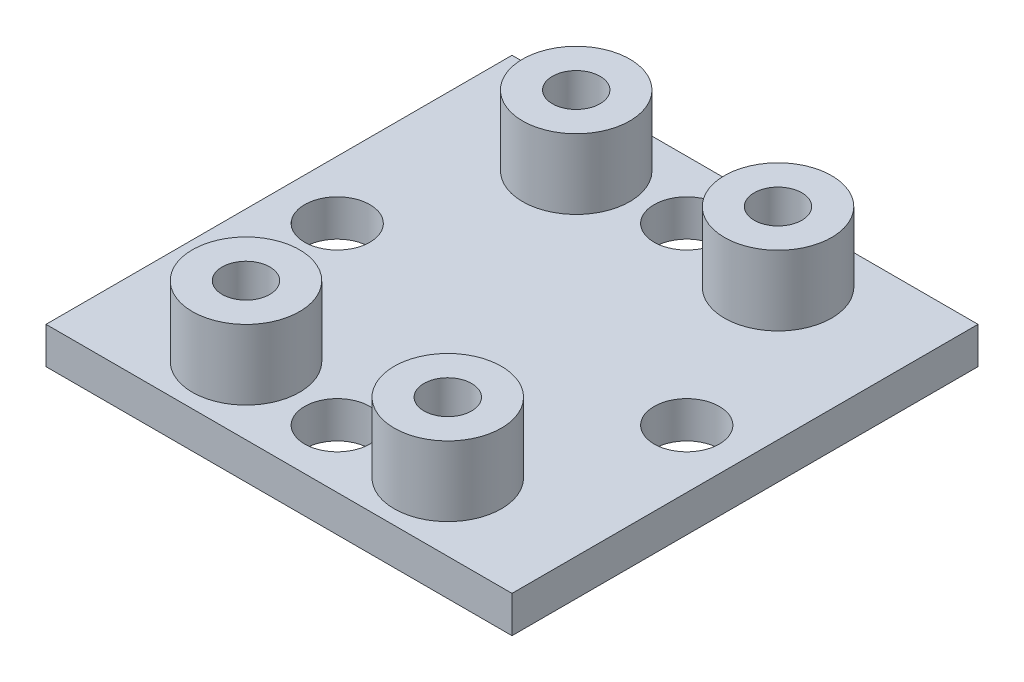
ISO-10303-21;
HEADER;
FILE_DESCRIPTION(('STEP AP214'),'2;1');
FILE_NAME('part.step','',(''),(''),'','','');
FILE_SCHEMA(('AUTOMOTIVE_DESIGN { 1 0 10303 214 1 1 1 1 }'));
ENDSEC;
DATA;
#1=APPLICATION_CONTEXT('core data for automotive mechanical design processes');
#2=APPLICATION_PROTOCOL_DEFINITION('international standard','automotive_design',2000,#1);
#3=PRODUCT_CONTEXT('',#1,'mechanical');
#4=PRODUCT('Part','Part','',(#3));
#5=PRODUCT_RELATED_PRODUCT_CATEGORY('part','',(#4));
#6=PRODUCT_DEFINITION_FORMATION('','',#4);
#7=PRODUCT_DEFINITION_CONTEXT('part definition',#1,'design');
#8=PRODUCT_DEFINITION('design','',#6,#7);
#9=PRODUCT_DEFINITION_SHAPE('','',#8);
#10=(LENGTH_UNIT() NAMED_UNIT(*) SI_UNIT(.MILLI.,.METRE.));
#11=(NAMED_UNIT(*) PLANE_ANGLE_UNIT() SI_UNIT($,.RADIAN.));
#12=(NAMED_UNIT(*) SI_UNIT($,.STERADIAN.) SOLID_ANGLE_UNIT());
#13=UNCERTAINTY_MEASURE_WITH_UNIT(LENGTH_MEASURE(1.E-05),#10,'distance_accuracy_value','');
#14=(GEOMETRIC_REPRESENTATION_CONTEXT(3) GLOBAL_UNCERTAINTY_ASSIGNED_CONTEXT((#13)) GLOBAL_UNIT_ASSIGNED_CONTEXT((#10,
#11,#12)) REPRESENTATION_CONTEXT('',''));
#15=CARTESIAN_POINT('',(0.,0.,0.));
#16=DIRECTION('',(0.,0.,1.));
#17=DIRECTION('',(1.,0.,0.));
#18=AXIS2_PLACEMENT_3D('',#15,#16,#17);
#19=CARTESIAN_POINT('',(-12.7,2.,-12.7));
#20=DIRECTION('',(1.,0.,0.));
#21=DIRECTION('',(0.,0.,-1.));
#22=AXIS2_PLACEMENT_3D('',#19,#20,#21);
#23=PLANE('',#22);
#24=DIRECTION('',(0.,0.,1.));
#25=VECTOR('',#24,1.);
#26=CARTESIAN_POINT('',(-12.7,0.,-12.7));
#27=LINE('',#26,#25);
#28=CARTESIAN_POINT('',(-12.7,0.,-12.7));
#29=VERTEX_POINT('',#28);
#30=CARTESIAN_POINT('',(-12.7,0.,12.7));
#31=VERTEX_POINT('',#30);
#32=EDGE_CURVE('E103',#29,#31,#27,.T.);
#33=ORIENTED_EDGE('',*,*,#32,.T.);
#34=DIRECTION('',(0.,-1.,0.));
#35=VECTOR('',#34,1.);
#36=CARTESIAN_POINT('',(-12.7,2.,12.7));
#37=LINE('',#36,#35);
#38=CARTESIAN_POINT('',(-12.7,2.,12.7));
#39=VERTEX_POINT('',#38);
#40=EDGE_CURVE('E94',#39,#31,#37,.T.);
#41=ORIENTED_EDGE('',*,*,#40,.F.);
#42=DIRECTION('',(0.,0.,1.));
#43=VECTOR('',#42,1.);
#44=CARTESIAN_POINT('',(-12.7,2.,-12.7));
#45=LINE('',#44,#43);
#46=CARTESIAN_POINT('',(-12.7,2.,-12.7));
#47=VERTEX_POINT('',#46);
#48=EDGE_CURVE('E88',#47,#39,#45,.T.);
#49=ORIENTED_EDGE('',*,*,#48,.F.);
#50=DIRECTION('',(0.,-1.,0.));
#51=VECTOR('',#50,1.);
#52=CARTESIAN_POINT('',(-12.7,2.,-12.7));
#53=LINE('',#52,#51);
#54=EDGE_CURVE('E99',#47,#29,#53,.T.);
#55=ORIENTED_EDGE('',*,*,#54,.T.);
#56=EDGE_LOOP('',(#33,#41,#49,#55));
#57=FACE_BOUND('',#56,.T.);
#58=ADVANCED_FACE('F36',(#57),#23,.F.);
#59=CARTESIAN_POINT('',(-12.7,2.,12.7));
#60=DIRECTION('',(0.,0.,-1.));
#61=DIRECTION('',(-1.,0.,0.));
#62=AXIS2_PLACEMENT_3D('',#59,#60,#61);
#63=PLANE('',#62);
#64=DIRECTION('',(1.,0.,0.));
#65=VECTOR('',#64,1.);
#66=CARTESIAN_POINT('',(-12.7,0.,12.7));
#67=LINE('',#66,#65);
#68=CARTESIAN_POINT('',(12.7,0.,12.7));
#69=VERTEX_POINT('',#68);
#70=EDGE_CURVE('E93',#31,#69,#67,.T.);
#71=ORIENTED_EDGE('',*,*,#70,.T.);
#72=DIRECTION('',(0.,-1.,0.));
#73=VECTOR('',#72,1.);
#74=CARTESIAN_POINT('',(12.7,2.,12.7));
#75=LINE('',#74,#73);
#76=CARTESIAN_POINT('',(12.7,2.,12.7));
#77=VERTEX_POINT('',#76);
#78=EDGE_CURVE('E91',#77,#69,#75,.T.);
#79=ORIENTED_EDGE('',*,*,#78,.F.);
#80=DIRECTION('',(1.,0.,0.));
#81=VECTOR('',#80,1.);
#82=CARTESIAN_POINT('',(-12.7,2.,12.7));
#83=LINE('',#82,#81);
#84=EDGE_CURVE('E83',#39,#77,#83,.T.);
#85=ORIENTED_EDGE('',*,*,#84,.F.);
#86=ORIENTED_EDGE('',*,*,#40,.T.);
#87=EDGE_LOOP('',(#71,#79,#85,#86));
#88=FACE_BOUND('',#87,.T.);
#89=ADVANCED_FACE('F92',(#88),#63,.F.);
#90=CARTESIAN_POINT('',(12.7,2.,-12.7));
#91=DIRECTION('',(-1.,0.,0.));
#92=DIRECTION('',(0.,0.,1.));
#93=AXIS2_PLACEMENT_3D('',#90,#91,#92);
#94=PLANE('',#93);
#95=DIRECTION('',(0.,0.,-1.));
#96=VECTOR('',#95,1.);
#97=CARTESIAN_POINT('',(12.7,0.,-12.7));
#98=LINE('',#97,#96);
#99=CARTESIAN_POINT('',(12.7,0.,-12.7));
#100=VERTEX_POINT('',#99);
#101=EDGE_CURVE('E69',#69,#100,#98,.T.);
#102=ORIENTED_EDGE('',*,*,#101,.T.);
#103=DIRECTION('',(0.,-1.,0.));
#104=VECTOR('',#103,1.);
#105=CARTESIAN_POINT('',(12.7,2.,-12.7));
#106=LINE('',#105,#104);
#107=CARTESIAN_POINT('',(12.7,2.,-12.7));
#108=VERTEX_POINT('',#107);
#109=EDGE_CURVE('E95',#108,#100,#106,.T.);
#110=ORIENTED_EDGE('',*,*,#109,.F.);
#111=DIRECTION('',(0.,0.,-1.));
#112=VECTOR('',#111,1.);
#113=CARTESIAN_POINT('',(12.7,2.,-12.7));
#114=LINE('',#113,#112);
#115=EDGE_CURVE('E86',#77,#108,#114,.T.);
#116=ORIENTED_EDGE('',*,*,#115,.F.);
#117=ORIENTED_EDGE('',*,*,#78,.T.);
#118=EDGE_LOOP('',(#102,#110,#116,#117));
#119=FACE_BOUND('',#118,.T.);
#120=ADVANCED_FACE('F97',(#119),#94,.F.);
#121=CARTESIAN_POINT('',(-12.7,2.,-12.7));
#122=DIRECTION('',(0.,0.,1.));
#123=DIRECTION('',(1.,0.,0.));
#124=AXIS2_PLACEMENT_3D('',#121,#122,#123);
#125=PLANE('',#124);
#126=DIRECTION('',(-1.,0.,0.));
#127=VECTOR('',#126,1.);
#128=CARTESIAN_POINT('',(-12.7,0.,-12.7));
#129=LINE('',#128,#127);
#130=EDGE_CURVE('E75',#100,#29,#129,.T.);
#131=ORIENTED_EDGE('',*,*,#130,.T.);
#132=ORIENTED_EDGE('',*,*,#54,.F.);
#133=DIRECTION('',(-1.,0.,0.));
#134=VECTOR('',#133,1.);
#135=CARTESIAN_POINT('',(-12.7,2.,-12.7));
#136=LINE('',#135,#134);
#137=EDGE_CURVE('E52',#108,#47,#136,.T.);
#138=ORIENTED_EDGE('',*,*,#137,.F.);
#139=ORIENTED_EDGE('',*,*,#109,.T.);
#140=EDGE_LOOP('',(#131,#132,#138,#139));
#141=FACE_BOUND('',#140,.T.);
#142=ADVANCED_FACE('F167',(#141),#125,.F.);
#143=CARTESIAN_POINT('',(0.,2.,0.));
#144=DIRECTION('',(0.,1.,0.));
#145=DIRECTION('',(0.,0.,1.));
#146=AXIS2_PLACEMENT_3D('',#143,#144,#145);
#147=PLANE('',#146);
#148=CARTESIAN_POINT('',(0.,2.,-9.525));
#149=DIRECTION('',(0.,1.,0.));
#150=DIRECTION('',(0.,0.,1.));
#151=AXIS2_PLACEMENT_3D('',#148,#149,#150);
#152=CIRCLE('',#151,1.778);
#153=CARTESIAN_POINT('',(0.,2.,-7.747));
#154=VERTEX_POINT('',#153);
#155=EDGE_CURVE('E320',#154,#154,#152,.F.);
#156=ORIENTED_EDGE('',*,*,#155,.T.);
#157=EDGE_LOOP('',(#156));
#158=FACE_BOUND('',#157,.T.);
#159=CARTESIAN_POINT('',(9.525,2.,0.));
#160=DIRECTION('',(0.,1.,0.));
#161=DIRECTION('',(0.,0.,1.));
#162=AXIS2_PLACEMENT_3D('',#159,#160,#161);
#163=CIRCLE('',#162,1.778);
#164=CARTESIAN_POINT('',(9.525,2.,1.778));
#165=VERTEX_POINT('',#164);
#166=EDGE_CURVE('E323',#165,#165,#163,.F.);
#167=ORIENTED_EDGE('',*,*,#166,.T.);
#168=EDGE_LOOP('',(#167));
#169=FACE_BOUND('',#168,.T.);
#170=CARTESIAN_POINT('',(0.,2.,9.525));
#171=DIRECTION('',(0.,1.,0.));
#172=DIRECTION('',(0.,0.,1.));
#173=AXIS2_PLACEMENT_3D('',#170,#171,#172);
#174=CIRCLE('',#173,1.778);
#175=CARTESIAN_POINT('',(0.,2.,11.303));
#176=VERTEX_POINT('',#175);
#177=EDGE_CURVE('E326',#176,#176,#174,.F.);
#178=ORIENTED_EDGE('',*,*,#177,.T.);
#179=EDGE_LOOP('',(#178));
#180=FACE_BOUND('',#179,.T.);
#181=CARTESIAN_POINT('',(-5.5,2.,9.));
#182=DIRECTION('',(0.,1.,0.));
#183=DIRECTION('',(0.,0.,1.));
#184=AXIS2_PLACEMENT_3D('',#181,#182,#183);
#185=CIRCLE('',#184,2.921);
#186=CARTESIAN_POINT('',(-5.5,2.,11.921));
#187=VERTEX_POINT('',#186);
#188=EDGE_CURVE('E312',#187,#187,#185,.T.);
#189=ORIENTED_EDGE('',*,*,#188,.F.);
#190=EDGE_LOOP('',(#189));
#191=FACE_BOUND('',#190,.T.);
#192=CARTESIAN_POINT('',(5.5,2.,9.));
#193=DIRECTION('',(0.,1.,0.));
#194=DIRECTION('',(0.,0.,1.));
#195=AXIS2_PLACEMENT_3D('',#192,#193,#194);
#196=CIRCLE('',#195,2.921);
#197=CARTESIAN_POINT('',(5.5,2.,11.921));
#198=VERTEX_POINT('',#197);
#199=EDGE_CURVE('E303',#198,#198,#196,.T.);
#200=ORIENTED_EDGE('',*,*,#199,.F.);
#201=EDGE_LOOP('',(#200));
#202=FACE_BOUND('',#201,.T.);
#203=CARTESIAN_POINT('',(5.5,2.,-9.));
#204=DIRECTION('',(0.,1.,0.));
#205=DIRECTION('',(0.,0.,1.));
#206=AXIS2_PLACEMENT_3D('',#203,#204,#205);
#207=CIRCLE('',#206,2.921);
#208=CARTESIAN_POINT('',(5.5,2.,-6.079));
#209=VERTEX_POINT('',#208);
#210=EDGE_CURVE('E294',#209,#209,#207,.T.);
#211=ORIENTED_EDGE('',*,*,#210,.F.);
#212=EDGE_LOOP('',(#211));
#213=FACE_BOUND('',#212,.T.);
#214=CARTESIAN_POINT('',(-5.5,2.,-9.));
#215=DIRECTION('',(0.,1.,0.));
#216=DIRECTION('',(0.,0.,1.));
#217=AXIS2_PLACEMENT_3D('',#214,#215,#216);
#218=CIRCLE('',#217,2.921);
#219=CARTESIAN_POINT('',(-5.5,2.,-6.079));
#220=VERTEX_POINT('',#219);
#221=EDGE_CURVE('E275',#220,#220,#218,.T.);
#222=ORIENTED_EDGE('',*,*,#221,.F.);
#223=EDGE_LOOP('',(#222));
#224=FACE_BOUND('',#223,.T.);
#225=CARTESIAN_POINT('',(-9.525,2.,0.));
#226=DIRECTION('',(0.,1.,0.));
#227=DIRECTION('',(0.,0.,1.));
#228=AXIS2_PLACEMENT_3D('',#225,#226,#227);
#229=CIRCLE('',#228,1.778);
#230=CARTESIAN_POINT('',(-9.525,2.,1.778));
#231=VERTEX_POINT('',#230);
#232=EDGE_CURVE('E106',#231,#231,#229,.T.);
#233=ORIENTED_EDGE('',*,*,#232,.F.);
#234=EDGE_LOOP('',(#233));
#235=FACE_BOUND('',#234,.T.);
#236=ORIENTED_EDGE('',*,*,#48,.T.);
#237=ORIENTED_EDGE('',*,*,#84,.T.);
#238=ORIENTED_EDGE('',*,*,#115,.T.);
#239=ORIENTED_EDGE('',*,*,#137,.T.);
#240=EDGE_LOOP('',(#236,#237,#238,#239));
#241=FACE_BOUND('',#240,.T.);
#242=ADVANCED_FACE('F84',(#158,#169,#180,#191,#202,#213,#224,#235,#241),#147,.T.);
#243=CARTESIAN_POINT('',(0.,0.,0.));
#244=DIRECTION('',(0.,1.,0.));
#245=DIRECTION('',(0.,0.,1.));
#246=AXIS2_PLACEMENT_3D('',#243,#244,#245);
#247=PLANE('',#246);
#248=CARTESIAN_POINT('',(0.,0.,-9.525));
#249=DIRECTION('',(0.,1.,0.));
#250=DIRECTION('',(-1.,0.,0.));
#251=AXIS2_PLACEMENT_3D('',#248,#249,#250);
#252=CIRCLE('',#251,1.778);
#253=CARTESIAN_POINT('',(-1.77799999999997,0.,-9.52500000000001));
#254=VERTEX_POINT('',#253);
#255=EDGE_CURVE('E329',#254,#254,#252,.T.);
#256=ORIENTED_EDGE('',*,*,#255,.T.);
#257=EDGE_LOOP('',(#256));
#258=FACE_BOUND('',#257,.T.);
#259=CARTESIAN_POINT('',(9.525,0.,0.));
#260=DIRECTION('',(0.,1.,0.));
#261=DIRECTION('',(0.,0.,-1.));
#262=AXIS2_PLACEMENT_3D('',#259,#260,#261);
#263=CIRCLE('',#262,1.778);
#264=CARTESIAN_POINT('',(9.525,0.,-1.778));
#265=VERTEX_POINT('',#264);
#266=EDGE_CURVE('E333',#265,#265,#263,.T.);
#267=ORIENTED_EDGE('',*,*,#266,.T.);
#268=EDGE_LOOP('',(#267));
#269=FACE_BOUND('',#268,.T.);
#270=CARTESIAN_POINT('',(0.,0.,9.525));
#271=DIRECTION('',(0.,1.,0.));
#272=DIRECTION('',(1.,0.,0.));
#273=AXIS2_PLACEMENT_3D('',#270,#271,#272);
#274=CIRCLE('',#273,1.778);
#275=CARTESIAN_POINT('',(1.7779999999999,0.,9.52500000000002));
#276=VERTEX_POINT('',#275);
#277=EDGE_CURVE('E330',#276,#276,#274,.T.);
#278=ORIENTED_EDGE('',*,*,#277,.T.);
#279=EDGE_LOOP('',(#278));
#280=FACE_BOUND('',#279,.T.);
#281=CARTESIAN_POINT('',(-9.525,0.,0.));
#282=DIRECTION('',(0.,1.,0.));
#283=DIRECTION('',(0.,0.,1.));
#284=AXIS2_PLACEMENT_3D('',#281,#282,#283);
#285=CIRCLE('',#284,1.778);
#286=CARTESIAN_POINT('',(-9.525,0.,1.778));
#287=VERTEX_POINT('',#286);
#288=EDGE_CURVE('E279',#287,#287,#285,.T.);
#289=ORIENTED_EDGE('',*,*,#288,.T.);
#290=EDGE_LOOP('',(#289));
#291=FACE_BOUND('',#290,.T.);
#292=ORIENTED_EDGE('',*,*,#32,.F.);
#293=ORIENTED_EDGE('',*,*,#130,.F.);
#294=ORIENTED_EDGE('',*,*,#101,.F.);
#295=ORIENTED_EDGE('',*,*,#70,.F.);
#296=EDGE_LOOP('',(#292,#293,#294,#295));
#297=FACE_BOUND('',#296,.T.);
#298=ADVANCED_FACE('F157',(#258,#269,#280,#291,#297),#247,.F.);
#299=CARTESIAN_POINT('',(-9.525,2.,0.));
#300=DIRECTION('',(0.,-1.,0.));
#301=DIRECTION('',(0.,0.,-1.));
#302=AXIS2_PLACEMENT_3D('',#299,#300,#301);
#303=CYLINDRICAL_SURFACE('',#302,1.778);
#304=ORIENTED_EDGE('',*,*,#232,.T.);
#305=EDGE_LOOP('',(#304));
#306=FACE_BOUND('',#305,.T.);
#307=ORIENTED_EDGE('',*,*,#288,.F.);
#308=EDGE_LOOP('',(#307));
#309=FACE_BOUND('',#308,.T.);
#310=ADVANCED_FACE('F159',(#306,#309),#303,.F.);
#311=CARTESIAN_POINT('',(-5.5,5.81,-9.));
#312=DIRECTION('',(0.,1.,0.));
#313=DIRECTION('',(0.,0.,1.));
#314=AXIS2_PLACEMENT_3D('',#311,#312,#313);
#315=PLANE('',#314);
#316=CARTESIAN_POINT('',(-5.5,5.81,-9.));
#317=DIRECTION('',(0.,1.,0.));
#318=DIRECTION('',(0.,0.,1.));
#319=AXIS2_PLACEMENT_3D('',#316,#317,#318);
#320=CIRCLE('',#319,2.921);
#321=CARTESIAN_POINT('',(-5.5,5.81,-6.079));
#322=VERTEX_POINT('',#321);
#323=EDGE_CURVE('E272',#322,#322,#320,.T.);
#324=ORIENTED_EDGE('',*,*,#323,.T.);
#325=EDGE_LOOP('',(#324));
#326=FACE_BOUND('',#325,.T.);
#327=CARTESIAN_POINT('',(-5.5,5.81,-9.));
#328=DIRECTION('',(0.,1.,0.));
#329=DIRECTION('',(0.,0.,1.));
#330=AXIS2_PLACEMENT_3D('',#327,#328,#329);
#331=CIRCLE('',#330,1.3);
#332=CARTESIAN_POINT('',(-5.5,5.81,-7.7));
#333=VERTEX_POINT('',#332);
#334=EDGE_CURVE('E277',#333,#333,#331,.T.);
#335=ORIENTED_EDGE('',*,*,#334,.F.);
#336=EDGE_LOOP('',(#335));
#337=FACE_BOUND('',#336,.T.);
#338=ADVANCED_FACE('F165',(#326,#337),#315,.T.);
#339=CARTESIAN_POINT('',(-5.5,5.81,-9.));
#340=DIRECTION('',(0.,-1.,0.));
#341=DIRECTION('',(0.,0.,-1.));
#342=AXIS2_PLACEMENT_3D('',#339,#340,#341);
#343=CYLINDRICAL_SURFACE('',#342,2.921);
#344=ORIENTED_EDGE('',*,*,#323,.F.);
#345=EDGE_LOOP('',(#344));
#346=FACE_BOUND('',#345,.T.);
#347=ORIENTED_EDGE('',*,*,#221,.T.);
#348=EDGE_LOOP('',(#347));
#349=FACE_BOUND('',#348,.T.);
#350=ADVANCED_FACE('F260',(#346,#349),#343,.T.);
#351=CARTESIAN_POINT('',(-5.5,5.81,-9.));
#352=DIRECTION('',(0.,-1.,0.));
#353=DIRECTION('',(0.,0.,-1.));
#354=AXIS2_PLACEMENT_3D('',#351,#352,#353);
#355=CYLINDRICAL_SURFACE('',#354,1.3);
#356=ORIENTED_EDGE('',*,*,#334,.T.);
#357=EDGE_LOOP('',(#356));
#358=FACE_BOUND('',#357,.T.);
#359=CARTESIAN_POINT('',(-5.5,2.,-9.));
#360=DIRECTION('',(0.,1.,0.));
#361=DIRECTION('',(0.,0.,1.));
#362=AXIS2_PLACEMENT_3D('',#359,#360,#361);
#363=CIRCLE('',#362,1.3);
#364=CARTESIAN_POINT('',(-5.5,2.,-7.7));
#365=VERTEX_POINT('',#364);
#366=EDGE_CURVE('E113',#365,#365,#363,.F.);
#367=ORIENTED_EDGE('',*,*,#366,.T.);
#368=EDGE_LOOP('',(#367));
#369=FACE_BOUND('',#368,.T.);
#370=ADVANCED_FACE('F257',(#358,#369),#355,.F.);
#371=ORIENTED_EDGE('',*,*,#366,.F.);
#372=EDGE_LOOP('',(#371));
#373=FACE_BOUND('',#372,.T.);
#374=ADVANCED_FACE('F145',(#373),#147,.T.);
#375=CARTESIAN_POINT('',(5.5,5.81,-9.));
#376=DIRECTION('',(0.,1.,0.));
#377=DIRECTION('',(0.,0.,1.));
#378=AXIS2_PLACEMENT_3D('',#375,#376,#377);
#379=PLANE('',#378);
#380=CARTESIAN_POINT('',(5.5,5.81,-9.));
#381=DIRECTION('',(0.,1.,0.));
#382=DIRECTION('',(0.,0.,1.));
#383=AXIS2_PLACEMENT_3D('',#380,#381,#382);
#384=CIRCLE('',#383,2.921);
#385=CARTESIAN_POINT('',(5.5,5.81,-6.079));
#386=VERTEX_POINT('',#385);
#387=EDGE_CURVE('E282',#386,#386,#384,.T.);
#388=ORIENTED_EDGE('',*,*,#387,.T.);
#389=EDGE_LOOP('',(#388));
#390=FACE_BOUND('',#389,.T.);
#391=CARTESIAN_POINT('',(5.5,5.81,-9.));
#392=DIRECTION('',(0.,1.,0.));
#393=DIRECTION('',(0.,0.,1.));
#394=AXIS2_PLACEMENT_3D('',#391,#392,#393);
#395=CIRCLE('',#394,1.3);
#396=CARTESIAN_POINT('',(5.5,5.81,-7.7));
#397=VERTEX_POINT('',#396);
#398=EDGE_CURVE('E297',#397,#397,#395,.T.);
#399=ORIENTED_EDGE('',*,*,#398,.F.);
#400=EDGE_LOOP('',(#399));
#401=FACE_BOUND('',#400,.T.);
#402=ADVANCED_FACE('F250',(#390,#401),#379,.T.);
#403=CARTESIAN_POINT('',(5.5,5.81,-9.));
#404=DIRECTION('',(0.,-1.,0.));
#405=DIRECTION('',(0.,0.,-1.));
#406=AXIS2_PLACEMENT_3D('',#403,#404,#405);
#407=CYLINDRICAL_SURFACE('',#406,2.921);
#408=ORIENTED_EDGE('',*,*,#387,.F.);
#409=EDGE_LOOP('',(#408));
#410=FACE_BOUND('',#409,.T.);
#411=ORIENTED_EDGE('',*,*,#210,.T.);
#412=EDGE_LOOP('',(#411));
#413=FACE_BOUND('',#412,.T.);
#414=ADVANCED_FACE('F248',(#410,#413),#407,.T.);
#415=CARTESIAN_POINT('',(5.5,5.81,-9.));
#416=DIRECTION('',(0.,-1.,0.));
#417=DIRECTION('',(0.,0.,-1.));
#418=AXIS2_PLACEMENT_3D('',#415,#416,#417);
#419=CYLINDRICAL_SURFACE('',#418,1.3);
#420=ORIENTED_EDGE('',*,*,#398,.T.);
#421=EDGE_LOOP('',(#420));
#422=FACE_BOUND('',#421,.T.);
#423=CARTESIAN_POINT('',(5.5,2.,-9.));
#424=DIRECTION('',(0.,1.,0.));
#425=DIRECTION('',(0.,0.,1.));
#426=AXIS2_PLACEMENT_3D('',#423,#424,#425);
#427=CIRCLE('',#426,1.3);
#428=CARTESIAN_POINT('',(5.5,2.,-7.7));
#429=VERTEX_POINT('',#428);
#430=EDGE_CURVE('E116',#429,#429,#427,.F.);
#431=ORIENTED_EDGE('',*,*,#430,.T.);
#432=EDGE_LOOP('',(#431));
#433=FACE_BOUND('',#432,.T.);
#434=ADVANCED_FACE('F143',(#422,#433),#419,.F.);
#435=ORIENTED_EDGE('',*,*,#430,.F.);
#436=EDGE_LOOP('',(#435));
#437=FACE_BOUND('',#436,.T.);
#438=ADVANCED_FACE('F127',(#437),#147,.T.);
#439=CARTESIAN_POINT('',(5.5,5.81,9.));
#440=DIRECTION('',(0.,1.,0.));
#441=DIRECTION('',(0.,0.,1.));
#442=AXIS2_PLACEMENT_3D('',#439,#440,#441);
#443=PLANE('',#442);
#444=CARTESIAN_POINT('',(5.5,5.81,9.));
#445=DIRECTION('',(0.,1.,0.));
#446=DIRECTION('',(0.,0.,1.));
#447=AXIS2_PLACEMENT_3D('',#444,#445,#446);
#448=CIRCLE('',#447,2.921);
#449=CARTESIAN_POINT('',(5.5,5.81,11.921));
#450=VERTEX_POINT('',#449);
#451=EDGE_CURVE('E302',#450,#450,#448,.T.);
#452=ORIENTED_EDGE('',*,*,#451,.T.);
#453=EDGE_LOOP('',(#452));
#454=FACE_BOUND('',#453,.T.);
#455=CARTESIAN_POINT('',(5.5,5.81,9.));
#456=DIRECTION('',(0.,1.,0.));
#457=DIRECTION('',(0.,0.,1.));
#458=AXIS2_PLACEMENT_3D('',#455,#456,#457);
#459=CIRCLE('',#458,1.3);
#460=CARTESIAN_POINT('',(5.5,5.81,10.3));
#461=VERTEX_POINT('',#460);
#462=EDGE_CURVE('E306',#461,#461,#459,.T.);
#463=ORIENTED_EDGE('',*,*,#462,.F.);
#464=EDGE_LOOP('',(#463));
#465=FACE_BOUND('',#464,.T.);
#466=ADVANCED_FACE('F142',(#454,#465),#443,.T.);
#467=CARTESIAN_POINT('',(5.5,5.81,9.));
#468=DIRECTION('',(0.,-1.,0.));
#469=DIRECTION('',(0.,0.,-1.));
#470=AXIS2_PLACEMENT_3D('',#467,#468,#469);
#471=CYLINDRICAL_SURFACE('',#470,2.921);
#472=ORIENTED_EDGE('',*,*,#451,.F.);
#473=EDGE_LOOP('',(#472));
#474=FACE_BOUND('',#473,.T.);
#475=ORIENTED_EDGE('',*,*,#199,.T.);
#476=EDGE_LOOP('',(#475));
#477=FACE_BOUND('',#476,.T.);
#478=ADVANCED_FACE('F136',(#474,#477),#471,.T.);
#479=CARTESIAN_POINT('',(5.5,5.81,9.));
#480=DIRECTION('',(0.,-1.,0.));
#481=DIRECTION('',(0.,0.,-1.));
#482=AXIS2_PLACEMENT_3D('',#479,#480,#481);
#483=CYLINDRICAL_SURFACE('',#482,1.3);
#484=ORIENTED_EDGE('',*,*,#462,.T.);
#485=EDGE_LOOP('',(#484));
#486=FACE_BOUND('',#485,.T.);
#487=CARTESIAN_POINT('',(5.5,2.,9.));
#488=DIRECTION('',(0.,1.,0.));
#489=DIRECTION('',(0.,0.,1.));
#490=AXIS2_PLACEMENT_3D('',#487,#488,#489);
#491=CIRCLE('',#490,1.3);
#492=CARTESIAN_POINT('',(5.5,2.,10.3));
#493=VERTEX_POINT('',#492);
#494=EDGE_CURVE('E44',#493,#493,#491,.F.);
#495=ORIENTED_EDGE('',*,*,#494,.T.);
#496=EDGE_LOOP('',(#495));
#497=FACE_BOUND('',#496,.T.);
#498=ADVANCED_FACE('F121',(#486,#497),#483,.F.);
#499=ORIENTED_EDGE('',*,*,#494,.F.);
#500=EDGE_LOOP('',(#499));
#501=FACE_BOUND('',#500,.T.);
#502=ADVANCED_FACE('F123',(#501),#147,.T.);
#503=CARTESIAN_POINT('',(-5.5,5.81,9.));
#504=DIRECTION('',(0.,1.,0.));
#505=DIRECTION('',(0.,0.,1.));
#506=AXIS2_PLACEMENT_3D('',#503,#504,#505);
#507=PLANE('',#506);
#508=CARTESIAN_POINT('',(-5.5,5.81,9.));
#509=DIRECTION('',(0.,1.,0.));
#510=DIRECTION('',(0.,0.,1.));
#511=AXIS2_PLACEMENT_3D('',#508,#509,#510);
#512=CIRCLE('',#511,2.921);
#513=CARTESIAN_POINT('',(-5.5,5.81,11.921));
#514=VERTEX_POINT('',#513);
#515=EDGE_CURVE('E311',#514,#514,#512,.T.);
#516=ORIENTED_EDGE('',*,*,#515,.T.);
#517=EDGE_LOOP('',(#516));
#518=FACE_BOUND('',#517,.T.);
#519=CARTESIAN_POINT('',(-5.5,5.81,9.));
#520=DIRECTION('',(0.,1.,0.));
#521=DIRECTION('',(0.,0.,1.));
#522=AXIS2_PLACEMENT_3D('',#519,#520,#521);
#523=CIRCLE('',#522,1.3);
#524=CARTESIAN_POINT('',(-5.5,5.81,10.3));
#525=VERTEX_POINT('',#524);
#526=EDGE_CURVE('E315',#525,#525,#523,.T.);
#527=ORIENTED_EDGE('',*,*,#526,.F.);
#528=EDGE_LOOP('',(#527));
#529=FACE_BOUND('',#528,.T.);
#530=ADVANCED_FACE('F125',(#518,#529),#507,.T.);
#531=CARTESIAN_POINT('',(-5.5,5.81,9.));
#532=DIRECTION('',(0.,-1.,0.));
#533=DIRECTION('',(0.,0.,-1.));
#534=AXIS2_PLACEMENT_3D('',#531,#532,#533);
#535=CYLINDRICAL_SURFACE('',#534,2.921);
#536=ORIENTED_EDGE('',*,*,#515,.F.);
#537=EDGE_LOOP('',(#536));
#538=FACE_BOUND('',#537,.T.);
#539=ORIENTED_EDGE('',*,*,#188,.T.);
#540=EDGE_LOOP('',(#539));
#541=FACE_BOUND('',#540,.T.);
#542=ADVANCED_FACE('F133',(#538,#541),#535,.T.);
#543=CARTESIAN_POINT('',(-5.5,5.81,9.));
#544=DIRECTION('',(0.,-1.,0.));
#545=DIRECTION('',(0.,0.,-1.));
#546=AXIS2_PLACEMENT_3D('',#543,#544,#545);
#547=CYLINDRICAL_SURFACE('',#546,1.3);
#548=ORIENTED_EDGE('',*,*,#526,.T.);
#549=EDGE_LOOP('',(#548));
#550=FACE_BOUND('',#549,.T.);
#551=CARTESIAN_POINT('',(-5.5,2.,9.));
#552=DIRECTION('',(0.,1.,0.));
#553=DIRECTION('',(0.,0.,1.));
#554=AXIS2_PLACEMENT_3D('',#551,#552,#553);
#555=CIRCLE('',#554,1.3);
#556=CARTESIAN_POINT('',(-5.5,2.,10.3));
#557=VERTEX_POINT('',#556);
#558=EDGE_CURVE('E11',#557,#557,#555,.F.);
#559=ORIENTED_EDGE('',*,*,#558,.T.);
#560=EDGE_LOOP('',(#559));
#561=FACE_BOUND('',#560,.T.);
#562=ADVANCED_FACE('F148',(#550,#561),#547,.F.);
#563=ORIENTED_EDGE('',*,*,#558,.F.);
#564=EDGE_LOOP('',(#563));
#565=FACE_BOUND('',#564,.T.);
#566=ADVANCED_FACE('F128',(#565),#147,.T.);
#567=CARTESIAN_POINT('',(0.,5.81,9.525));
#568=DIRECTION('',(0.,-1.,0.));
#569=DIRECTION('',(0.,0.,-1.));
#570=AXIS2_PLACEMENT_3D('',#567,#568,#569);
#571=CYLINDRICAL_SURFACE('',#570,1.778);
#572=ORIENTED_EDGE('',*,*,#177,.F.);
#573=EDGE_LOOP('',(#572));
#574=FACE_BOUND('',#573,.T.);
#575=ORIENTED_EDGE('',*,*,#277,.F.);
#576=EDGE_LOOP('',(#575));
#577=FACE_BOUND('',#576,.T.);
#578=ADVANCED_FACE('F147',(#574,#577),#571,.F.);
#579=CARTESIAN_POINT('',(9.525,5.81,0.));
#580=DIRECTION('',(0.,-1.,0.));
#581=DIRECTION('',(0.,0.,-1.));
#582=AXIS2_PLACEMENT_3D('',#579,#580,#581);
#583=CYLINDRICAL_SURFACE('',#582,1.778);
#584=ORIENTED_EDGE('',*,*,#166,.F.);
#585=EDGE_LOOP('',(#584));
#586=FACE_BOUND('',#585,.T.);
#587=ORIENTED_EDGE('',*,*,#266,.F.);
#588=EDGE_LOOP('',(#587));
#589=FACE_BOUND('',#588,.T.);
#590=ADVANCED_FACE('F206',(#586,#589),#583,.F.);
#591=CARTESIAN_POINT('',(0.,5.81,-9.525));
#592=DIRECTION('',(0.,-1.,0.));
#593=DIRECTION('',(0.,0.,-1.));
#594=AXIS2_PLACEMENT_3D('',#591,#592,#593);
#595=CYLINDRICAL_SURFACE('',#594,1.778);
#596=ORIENTED_EDGE('',*,*,#155,.F.);
#597=EDGE_LOOP('',(#596));
#598=FACE_BOUND('',#597,.T.);
#599=ORIENTED_EDGE('',*,*,#255,.F.);
#600=EDGE_LOOP('',(#599));
#601=FACE_BOUND('',#600,.T.);
#602=ADVANCED_FACE('F217',(#598,#601),#595,.F.);
#603=CLOSED_SHELL('',(#58,#89,#120,#142,#242,#298,#310,#338,#350,#370,#374,#402,#414,#434,#438,
#466,#478,#498,#502,#530,#542,#562,#566,#578,#590,#602));
#604=MANIFOLD_SOLID_BREP('B2',#603);
#605=ADVANCED_BREP_SHAPE_REPRESENTATION('',(#18,#604),#14);
#606=SHAPE_DEFINITION_REPRESENTATION(#9,#605);
ENDSEC;
END-ISO-10303-21;
